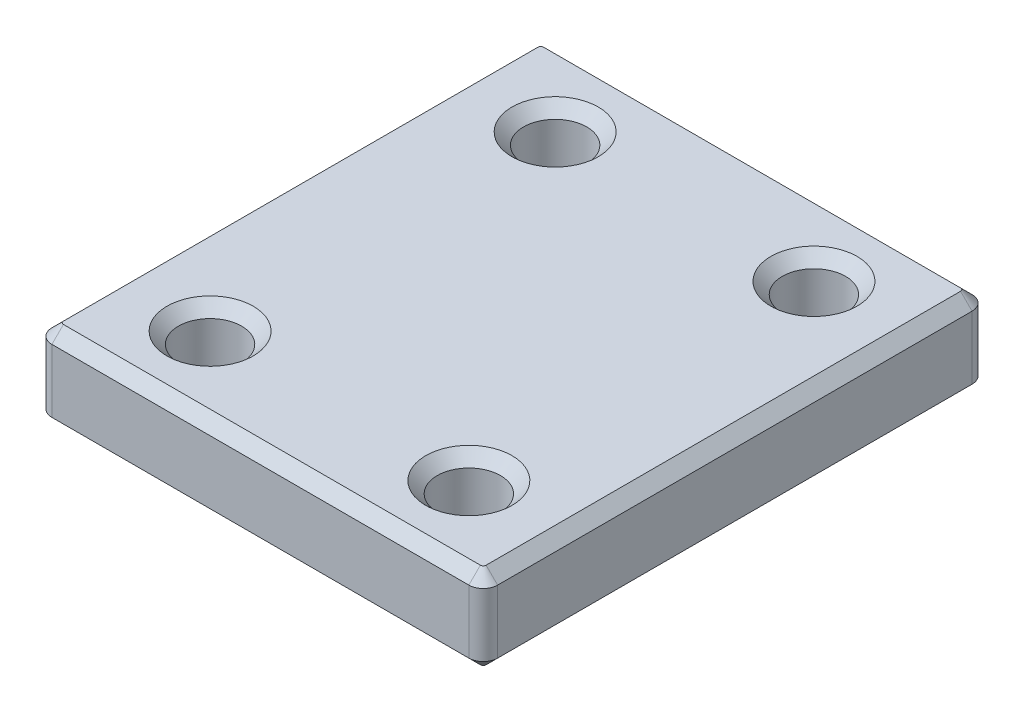
ISO-10303-21;
HEADER;
FILE_DESCRIPTION(('STEP AP214'),'2;1');
FILE_NAME('part.step','',(''),(''),'','','');
FILE_SCHEMA(('AUTOMOTIVE_DESIGN { 1 0 10303 214 1 1 1 1 }'));
ENDSEC;
DATA;
#1=APPLICATION_CONTEXT('core data for automotive mechanical design processes');
#2=APPLICATION_PROTOCOL_DEFINITION('international standard','automotive_design',2000,#1);
#3=PRODUCT_CONTEXT('',#1,'mechanical');
#4=PRODUCT('Part','Part','',(#3));
#5=PRODUCT_RELATED_PRODUCT_CATEGORY('part','',(#4));
#6=PRODUCT_DEFINITION_FORMATION('','',#4);
#7=PRODUCT_DEFINITION_CONTEXT('part definition',#1,'design');
#8=PRODUCT_DEFINITION('design','',#6,#7);
#9=PRODUCT_DEFINITION_SHAPE('','',#8);
#10=(LENGTH_UNIT() NAMED_UNIT(*) SI_UNIT(.MILLI.,.METRE.));
#11=(NAMED_UNIT(*) PLANE_ANGLE_UNIT() SI_UNIT($,.RADIAN.));
#12=(NAMED_UNIT(*) SI_UNIT($,.STERADIAN.) SOLID_ANGLE_UNIT());
#13=UNCERTAINTY_MEASURE_WITH_UNIT(LENGTH_MEASURE(1.E-05),#10,'distance_accuracy_value','');
#14=(GEOMETRIC_REPRESENTATION_CONTEXT(3) GLOBAL_UNCERTAINTY_ASSIGNED_CONTEXT((#13)) GLOBAL_UNIT_ASSIGNED_CONTEXT((#10,
#11,#12)) REPRESENTATION_CONTEXT('',''));
#15=CARTESIAN_POINT('',(0.,0.,0.));
#16=DIRECTION('',(0.,0.,1.));
#17=DIRECTION('',(1.,0.,0.));
#18=AXIS2_PLACEMENT_3D('',#15,#16,#17);
#19=CARTESIAN_POINT('',(15.5,6.,17.5));
#20=DIRECTION('',(-1.,0.,0.));
#21=DIRECTION('',(0.,0.,1.));
#22=AXIS2_PLACEMENT_3D('',#19,#20,#21);
#23=PLANE('',#22);
#24=DIRECTION('',(0.,-1.,0.));
#25=VECTOR('',#24,1.);
#26=CARTESIAN_POINT('',(15.5,6.,16.5));
#27=LINE('',#26,#25);
#28=CARTESIAN_POINT('',(15.5,5.2,16.5));
#29=VERTEX_POINT('',#28);
#30=CARTESIAN_POINT('',(15.5,0.799999999999995,16.5));
#31=VERTEX_POINT('',#30);
#32=EDGE_CURVE('E317',#29,#31,#27,.T.);
#33=ORIENTED_EDGE('',*,*,#32,.T.);
#34=DIRECTION('',(0.,0.,-1.));
#35=VECTOR('',#34,1.);
#36=CARTESIAN_POINT('',(15.5,0.799999999999995,-16.5));
#37=LINE('',#36,#35);
#38=CARTESIAN_POINT('',(15.5,0.799999999999995,-16.5));
#39=VERTEX_POINT('',#38);
#40=EDGE_CURVE('E186',#31,#39,#37,.T.);
#41=ORIENTED_EDGE('',*,*,#40,.T.);
#42=DIRECTION('',(0.,-1.,0.));
#43=VECTOR('',#42,1.);
#44=CARTESIAN_POINT('',(15.5,6.,-16.5));
#45=LINE('',#44,#43);
#46=CARTESIAN_POINT('',(15.5,5.2,-16.5));
#47=VERTEX_POINT('',#46);
#48=EDGE_CURVE('E339',#39,#47,#45,.F.);
#49=ORIENTED_EDGE('',*,*,#48,.T.);
#50=DIRECTION('',(0.,0.,1.));
#51=VECTOR('',#50,1.);
#52=CARTESIAN_POINT('',(15.5,5.2,17.5));
#53=LINE('',#52,#51);
#54=EDGE_CURVE('E184',#47,#29,#53,.T.);
#55=ORIENTED_EDGE('',*,*,#54,.T.);
#56=EDGE_LOOP('',(#33,#41,#49,#55));
#57=FACE_BOUND('',#56,.T.);
#58=ADVANCED_FACE('F35',(#57),#23,.F.);
#59=CARTESIAN_POINT('',(-15.5,6.,-17.5));
#60=DIRECTION('',(0.,0.,1.));
#61=DIRECTION('',(1.,0.,0.));
#62=AXIS2_PLACEMENT_3D('',#59,#60,#61);
#63=PLANE('',#62);
#64=DIRECTION('',(0.,-1.,0.));
#65=VECTOR('',#64,1.);
#66=CARTESIAN_POINT('',(14.5,6.,-17.5));
#67=LINE('',#66,#65);
#68=CARTESIAN_POINT('',(14.5,5.2,-17.5));
#69=VERTEX_POINT('',#68);
#70=CARTESIAN_POINT('',(14.5,0.799999999999995,-17.5));
#71=VERTEX_POINT('',#70);
#72=EDGE_CURVE('E332',#69,#71,#67,.T.);
#73=ORIENTED_EDGE('',*,*,#72,.T.);
#74=DIRECTION('',(-1.,0.,0.));
#75=VECTOR('',#74,1.);
#76=CARTESIAN_POINT('',(-14.5,0.799999999999995,-17.5));
#77=LINE('',#76,#75);
#78=CARTESIAN_POINT('',(-14.5,0.799999999999995,-17.5));
#79=VERTEX_POINT('',#78);
#80=EDGE_CURVE('E194',#71,#79,#77,.T.);
#81=ORIENTED_EDGE('',*,*,#80,.T.);
#82=DIRECTION('',(0.,-1.,0.));
#83=VECTOR('',#82,1.);
#84=CARTESIAN_POINT('',(-14.5,6.,-17.5));
#85=LINE('',#84,#83);
#86=CARTESIAN_POINT('',(-14.5,5.2,-17.5));
#87=VERTEX_POINT('',#86);
#88=EDGE_CURVE('E335',#79,#87,#85,.F.);
#89=ORIENTED_EDGE('',*,*,#88,.T.);
#90=DIRECTION('',(1.,0.,0.));
#91=VECTOR('',#90,1.);
#92=CARTESIAN_POINT('',(-15.5,5.2,-17.5));
#93=LINE('',#92,#91);
#94=EDGE_CURVE('E192',#87,#69,#93,.T.);
#95=ORIENTED_EDGE('',*,*,#94,.T.);
#96=EDGE_LOOP('',(#73,#81,#89,#95));
#97=FACE_BOUND('',#96,.T.);
#98=ADVANCED_FACE('F415',(#97),#63,.F.);
#99=CARTESIAN_POINT('',(-15.5,6.,17.5));
#100=DIRECTION('',(1.,0.,0.));
#101=DIRECTION('',(0.,0.,-1.));
#102=AXIS2_PLACEMENT_3D('',#99,#100,#101);
#103=PLANE('',#102);
#104=DIRECTION('',(0.,-1.,0.));
#105=VECTOR('',#104,1.);
#106=CARTESIAN_POINT('',(-15.5,6.,-16.5));
#107=LINE('',#106,#105);
#108=CARTESIAN_POINT('',(-15.5,5.2,-16.5));
#109=VERTEX_POINT('',#108);
#110=CARTESIAN_POINT('',(-15.5,0.799999999999995,-16.5));
#111=VERTEX_POINT('',#110);
#112=EDGE_CURVE('E324',#109,#111,#107,.T.);
#113=ORIENTED_EDGE('',*,*,#112,.T.);
#114=DIRECTION('',(0.,0.,1.));
#115=VECTOR('',#114,1.);
#116=CARTESIAN_POINT('',(-15.5,0.799999999999995,16.5));
#117=LINE('',#116,#115);
#118=CARTESIAN_POINT('',(-15.5,0.799999999999995,16.5));
#119=VERTEX_POINT('',#118);
#120=EDGE_CURVE('E203',#111,#119,#117,.T.);
#121=ORIENTED_EDGE('',*,*,#120,.T.);
#122=DIRECTION('',(0.,-1.,0.));
#123=VECTOR('',#122,1.);
#124=CARTESIAN_POINT('',(-15.5,6.,16.5));
#125=LINE('',#124,#123);
#126=CARTESIAN_POINT('',(-15.5,5.2,16.5));
#127=VERTEX_POINT('',#126);
#128=EDGE_CURVE('E329',#119,#127,#125,.F.);
#129=ORIENTED_EDGE('',*,*,#128,.T.);
#130=DIRECTION('',(0.,0.,-1.));
#131=VECTOR('',#130,1.);
#132=CARTESIAN_POINT('',(-15.5,5.2,17.5));
#133=LINE('',#132,#131);
#134=EDGE_CURVE('E201',#127,#109,#133,.T.);
#135=ORIENTED_EDGE('',*,*,#134,.T.);
#136=EDGE_LOOP('',(#113,#121,#129,#135));
#137=FACE_BOUND('',#136,.T.);
#138=ADVANCED_FACE('F399',(#137),#103,.F.);
#139=CARTESIAN_POINT('',(-15.5,6.,17.5));
#140=DIRECTION('',(0.,0.,-1.));
#141=DIRECTION('',(-1.,0.,0.));
#142=AXIS2_PLACEMENT_3D('',#139,#140,#141);
#143=PLANE('',#142);
#144=DIRECTION('',(0.,-1.,0.));
#145=VECTOR('',#144,1.);
#146=CARTESIAN_POINT('',(-14.5,6.,17.5));
#147=LINE('',#146,#145);
#148=CARTESIAN_POINT('',(-14.5,5.2,17.5));
#149=VERTEX_POINT('',#148);
#150=CARTESIAN_POINT('',(-14.5,0.799999999999995,17.5));
#151=VERTEX_POINT('',#150);
#152=EDGE_CURVE('E322',#149,#151,#147,.T.);
#153=ORIENTED_EDGE('',*,*,#152,.T.);
#154=DIRECTION('',(1.,0.,0.));
#155=VECTOR('',#154,1.);
#156=CARTESIAN_POINT('',(14.5,0.799999999999995,17.5));
#157=LINE('',#156,#155);
#158=CARTESIAN_POINT('',(14.5,0.799999999999995,17.5));
#159=VERTEX_POINT('',#158);
#160=EDGE_CURVE('E211',#151,#159,#157,.T.);
#161=ORIENTED_EDGE('',*,*,#160,.T.);
#162=DIRECTION('',(0.,-1.,0.));
#163=VECTOR('',#162,1.);
#164=CARTESIAN_POINT('',(14.5,6.,17.5));
#165=LINE('',#164,#163);
#166=CARTESIAN_POINT('',(14.5,5.2,17.5));
#167=VERTEX_POINT('',#166);
#168=EDGE_CURVE('E278',#159,#167,#165,.F.);
#169=ORIENTED_EDGE('',*,*,#168,.T.);
#170=DIRECTION('',(-1.,0.,0.));
#171=VECTOR('',#170,1.);
#172=CARTESIAN_POINT('',(-15.5,5.2,17.5));
#173=LINE('',#172,#171);
#174=EDGE_CURVE('E209',#167,#149,#173,.T.);
#175=ORIENTED_EDGE('',*,*,#174,.T.);
#176=EDGE_LOOP('',(#153,#161,#169,#175));
#177=FACE_BOUND('',#176,.T.);
#178=ADVANCED_FACE('F320',(#177),#143,.F.);
#179=CARTESIAN_POINT('',(0.,6.,0.));
#180=DIRECTION('',(0.,-1.,0.));
#181=DIRECTION('',(0.,0.,-1.));
#182=AXIS2_PLACEMENT_3D('',#179,#180,#181);
#183=PLANE('',#182);
#184=DIRECTION('',(-1.,0.,0.));
#185=VECTOR('',#184,1.);
#186=CARTESIAN_POINT('',(0.,6.,-16.7));
#187=LINE('',#186,#185);
#188=CARTESIAN_POINT('',(14.5,6.,-16.7));
#189=VERTEX_POINT('',#188);
#190=CARTESIAN_POINT('',(-14.5,6.,-16.7));
#191=VERTEX_POINT('',#190);
#192=EDGE_CURVE('E45',#189,#191,#187,.T.);
#193=ORIENTED_EDGE('',*,*,#192,.T.);
#194=CARTESIAN_POINT('',(-14.5,6.,-16.5));
#195=DIRECTION('',(0.,-1.,0.));
#196=DIRECTION('',(0.,0.,-1.));
#197=AXIS2_PLACEMENT_3D('',#194,#195,#196);
#198=CIRCLE('',#197,0.200000000000006);
#199=CARTESIAN_POINT('',(-14.7,6.,-16.5));
#200=VERTEX_POINT('',#199);
#201=EDGE_CURVE('E11',#191,#200,#198,.F.);
#202=ORIENTED_EDGE('',*,*,#201,.T.);
#203=DIRECTION('',(0.,0.,1.));
#204=VECTOR('',#203,1.);
#205=CARTESIAN_POINT('',(-14.7,6.,0.));
#206=LINE('',#205,#204);
#207=CARTESIAN_POINT('',(-14.7,6.,16.5));
#208=VERTEX_POINT('',#207);
#209=EDGE_CURVE('E249',#200,#208,#206,.T.);
#210=ORIENTED_EDGE('',*,*,#209,.T.);
#211=CARTESIAN_POINT('',(-14.5,6.,16.5));
#212=DIRECTION('',(0.,-1.,0.));
#213=DIRECTION('',(0.,0.,-1.));
#214=AXIS2_PLACEMENT_3D('',#211,#212,#213);
#215=CIRCLE('',#214,0.200000000000006);
#216=CARTESIAN_POINT('',(-14.5,6.,16.7));
#217=VERTEX_POINT('',#216);
#218=EDGE_CURVE('E251',#208,#217,#215,.F.);
#219=ORIENTED_EDGE('',*,*,#218,.T.);
#220=DIRECTION('',(1.,0.,0.));
#221=VECTOR('',#220,1.);
#222=CARTESIAN_POINT('',(0.,6.,16.7));
#223=LINE('',#222,#221);
#224=CARTESIAN_POINT('',(14.5,6.,16.7));
#225=VERTEX_POINT('',#224);
#226=EDGE_CURVE('E253',#217,#225,#223,.T.);
#227=ORIENTED_EDGE('',*,*,#226,.T.);
#228=CARTESIAN_POINT('',(14.5,6.,16.5));
#229=DIRECTION('',(0.,-1.,0.));
#230=DIRECTION('',(0.,0.,-1.));
#231=AXIS2_PLACEMENT_3D('',#228,#229,#230);
#232=CIRCLE('',#231,0.200000000000004);
#233=CARTESIAN_POINT('',(14.7,6.,16.5));
#234=VERTEX_POINT('',#233);
#235=EDGE_CURVE('E255',#225,#234,#232,.F.);
#236=ORIENTED_EDGE('',*,*,#235,.T.);
#237=DIRECTION('',(0.,0.,-1.));
#238=VECTOR('',#237,1.);
#239=CARTESIAN_POINT('',(14.7,6.,0.));
#240=LINE('',#239,#238);
#241=CARTESIAN_POINT('',(14.7,6.,-16.5));
#242=VERTEX_POINT('',#241);
#243=EDGE_CURVE('E257',#234,#242,#240,.T.);
#244=ORIENTED_EDGE('',*,*,#243,.T.);
#245=CARTESIAN_POINT('',(14.5,6.,-16.5));
#246=DIRECTION('',(0.,-1.,0.));
#247=DIRECTION('',(0.,0.,-1.));
#248=AXIS2_PLACEMENT_3D('',#245,#246,#247);
#249=CIRCLE('',#248,0.200000000000006);
#250=EDGE_CURVE('E56',#242,#189,#249,.F.);
#251=ORIENTED_EDGE('',*,*,#250,.T.);
#252=EDGE_LOOP('',(#193,#202,#210,#219,#227,#236,#244,#251));
#253=FACE_BOUND('',#252,.T.);
#254=CARTESIAN_POINT('',(9.,6.,-12.));
#255=DIRECTION('',(0.,-1.,0.));
#256=DIRECTION('',(0.,0.,-1.));
#257=AXIS2_PLACEMENT_3D('',#254,#255,#256);
#258=CIRCLE('',#257,2.99999999999999);
#259=CARTESIAN_POINT('',(9.,6.,-15.));
#260=VERTEX_POINT('',#259);
#261=EDGE_CURVE('E246',#260,#260,#258,.T.);
#262=ORIENTED_EDGE('',*,*,#261,.T.);
#263=EDGE_LOOP('',(#262));
#264=FACE_BOUND('',#263,.T.);
#265=CARTESIAN_POINT('',(-9.,6.,12.));
#266=DIRECTION('',(0.,-1.,0.));
#267=DIRECTION('',(0.,0.,-1.));
#268=AXIS2_PLACEMENT_3D('',#265,#266,#267);
#269=CIRCLE('',#268,2.99999999999999);
#270=CARTESIAN_POINT('',(-9.,6.,9.00000000000001));
#271=VERTEX_POINT('',#270);
#272=EDGE_CURVE('E243',#271,#271,#269,.T.);
#273=ORIENTED_EDGE('',*,*,#272,.T.);
#274=EDGE_LOOP('',(#273));
#275=FACE_BOUND('',#274,.T.);
#276=CARTESIAN_POINT('',(-9.,6.,-12.));
#277=DIRECTION('',(0.,-1.,0.));
#278=DIRECTION('',(0.,0.,-1.));
#279=AXIS2_PLACEMENT_3D('',#276,#277,#278);
#280=CIRCLE('',#279,2.99999999999999);
#281=CARTESIAN_POINT('',(-9.,6.,-15.));
#282=VERTEX_POINT('',#281);
#283=EDGE_CURVE('E240',#282,#282,#280,.T.);
#284=ORIENTED_EDGE('',*,*,#283,.T.);
#285=EDGE_LOOP('',(#284));
#286=FACE_BOUND('',#285,.T.);
#287=CARTESIAN_POINT('',(9.,6.,12.));
#288=DIRECTION('',(0.,-1.,0.));
#289=DIRECTION('',(0.,0.,-1.));
#290=AXIS2_PLACEMENT_3D('',#287,#288,#289);
#291=CIRCLE('',#290,2.99999999999999);
#292=CARTESIAN_POINT('',(9.,6.,9.00000000000001));
#293=VERTEX_POINT('',#292);
#294=EDGE_CURVE('E237',#293,#293,#291,.T.);
#295=ORIENTED_EDGE('',*,*,#294,.T.);
#296=EDGE_LOOP('',(#295));
#297=FACE_BOUND('',#296,.T.);
#298=ADVANCED_FACE('F386',(#253,#264,#275,#286,#297),#183,.F.);
#299=CARTESIAN_POINT('',(0.,0.,0.));
#300=DIRECTION('',(0.,-1.,0.));
#301=DIRECTION('',(0.,0.,-1.));
#302=AXIS2_PLACEMENT_3D('',#299,#300,#301);
#303=PLANE('',#302);
#304=DIRECTION('',(0.,0.,1.));
#305=VECTOR('',#304,1.);
#306=CARTESIAN_POINT('',(14.7,0.,16.5));
#307=LINE('',#306,#305);
#308=CARTESIAN_POINT('',(14.7,0.,-16.5));
#309=VERTEX_POINT('',#308);
#310=CARTESIAN_POINT('',(14.7,0.,16.5));
#311=VERTEX_POINT('',#310);
#312=EDGE_CURVE('E174',#309,#311,#307,.T.);
#313=ORIENTED_EDGE('',*,*,#312,.T.);
#314=CARTESIAN_POINT('',(14.5,0.,16.5));
#315=DIRECTION('',(0.,-1.,0.));
#316=DIRECTION('',(0.,0.,-1.));
#317=AXIS2_PLACEMENT_3D('',#314,#315,#316);
#318=CIRCLE('',#317,0.200000000000002);
#319=CARTESIAN_POINT('',(14.5,0.,16.7));
#320=VERTEX_POINT('',#319);
#321=EDGE_CURVE('E154',#311,#320,#318,.T.);
#322=ORIENTED_EDGE('',*,*,#321,.T.);
#323=DIRECTION('',(-1.,0.,0.));
#324=VECTOR('',#323,1.);
#325=CARTESIAN_POINT('',(-14.5,0.,16.7));
#326=LINE('',#325,#324);
#327=CARTESIAN_POINT('',(-14.5,0.,16.7));
#328=VERTEX_POINT('',#327);
#329=EDGE_CURVE('E162',#320,#328,#326,.T.);
#330=ORIENTED_EDGE('',*,*,#329,.T.);
#331=CARTESIAN_POINT('',(-14.5,0.,16.5));
#332=DIRECTION('',(0.,-1.,0.));
#333=DIRECTION('',(0.,0.,-1.));
#334=AXIS2_PLACEMENT_3D('',#331,#332,#333);
#335=CIRCLE('',#334,0.200000000000006);
#336=CARTESIAN_POINT('',(-14.7,0.,16.5));
#337=VERTEX_POINT('',#336);
#338=EDGE_CURVE('E168',#328,#337,#335,.T.);
#339=ORIENTED_EDGE('',*,*,#338,.T.);
#340=DIRECTION('',(0.,0.,-1.));
#341=VECTOR('',#340,1.);
#342=CARTESIAN_POINT('',(-14.7,0.,-16.5));
#343=LINE('',#342,#341);
#344=CARTESIAN_POINT('',(-14.7,0.,-16.5));
#345=VERTEX_POINT('',#344);
#346=EDGE_CURVE('E354',#337,#345,#343,.T.);
#347=ORIENTED_EDGE('',*,*,#346,.T.);
#348=CARTESIAN_POINT('',(-14.5,0.,-16.5));
#349=DIRECTION('',(0.,-1.,0.));
#350=DIRECTION('',(0.,0.,-1.));
#351=AXIS2_PLACEMENT_3D('',#348,#349,#350);
#352=CIRCLE('',#351,0.200000000000006);
#353=CARTESIAN_POINT('',(-14.5,0.,-16.7));
#354=VERTEX_POINT('',#353);
#355=EDGE_CURVE('E356',#345,#354,#352,.T.);
#356=ORIENTED_EDGE('',*,*,#355,.T.);
#357=DIRECTION('',(1.,0.,0.));
#358=VECTOR('',#357,1.);
#359=CARTESIAN_POINT('',(14.5,0.,-16.7));
#360=LINE('',#359,#358);
#361=CARTESIAN_POINT('',(14.5,0.,-16.7));
#362=VERTEX_POINT('',#361);
#363=EDGE_CURVE('E358',#354,#362,#360,.T.);
#364=ORIENTED_EDGE('',*,*,#363,.T.);
#365=CARTESIAN_POINT('',(14.5,0.,-16.5));
#366=DIRECTION('',(0.,-1.,0.));
#367=DIRECTION('',(0.,0.,-1.));
#368=AXIS2_PLACEMENT_3D('',#365,#366,#367);
#369=CIRCLE('',#368,0.200000000000006);
#370=EDGE_CURVE('E179',#362,#309,#369,.T.);
#371=ORIENTED_EDGE('',*,*,#370,.T.);
#372=EDGE_LOOP('',(#313,#322,#330,#339,#347,#356,#364,#371));
#373=FACE_BOUND('',#372,.T.);
#374=CARTESIAN_POINT('',(9.,0.,-12.));
#375=DIRECTION('',(0.,-1.,0.));
#376=DIRECTION('',(0.,0.,-1.));
#377=AXIS2_PLACEMENT_3D('',#374,#375,#376);
#378=CIRCLE('',#377,3.);
#379=CARTESIAN_POINT('',(9.,0.,-15.));
#380=VERTEX_POINT('',#379);
#381=EDGE_CURVE('E169',#380,#380,#378,.F.);
#382=ORIENTED_EDGE('',*,*,#381,.T.);
#383=EDGE_LOOP('',(#382));
#384=FACE_BOUND('',#383,.T.);
#385=CARTESIAN_POINT('',(-9.,0.,12.));
#386=DIRECTION('',(0.,-1.,0.));
#387=DIRECTION('',(0.,0.,-1.));
#388=AXIS2_PLACEMENT_3D('',#385,#386,#387);
#389=CIRCLE('',#388,3.);
#390=CARTESIAN_POINT('',(-9.,0.,9.));
#391=VERTEX_POINT('',#390);
#392=EDGE_CURVE('E348',#391,#391,#389,.F.);
#393=ORIENTED_EDGE('',*,*,#392,.T.);
#394=EDGE_LOOP('',(#393));
#395=FACE_BOUND('',#394,.T.);
#396=CARTESIAN_POINT('',(-9.,0.,-12.));
#397=DIRECTION('',(0.,-1.,0.));
#398=DIRECTION('',(0.,0.,-1.));
#399=AXIS2_PLACEMENT_3D('',#396,#397,#398);
#400=CIRCLE('',#399,3.);
#401=CARTESIAN_POINT('',(-9.,0.,-15.));
#402=VERTEX_POINT('',#401);
#403=EDGE_CURVE('E345',#402,#402,#400,.F.);
#404=ORIENTED_EDGE('',*,*,#403,.T.);
#405=EDGE_LOOP('',(#404));
#406=FACE_BOUND('',#405,.T.);
#407=CARTESIAN_POINT('',(9.,0.,12.));
#408=DIRECTION('',(0.,-1.,0.));
#409=DIRECTION('',(0.,0.,-1.));
#410=AXIS2_PLACEMENT_3D('',#407,#408,#409);
#411=CIRCLE('',#410,3.);
#412=CARTESIAN_POINT('',(9.,0.,9.));
#413=VERTEX_POINT('',#412);
#414=EDGE_CURVE('E342',#413,#413,#411,.F.);
#415=ORIENTED_EDGE('',*,*,#414,.T.);
#416=EDGE_LOOP('',(#415));
#417=FACE_BOUND('',#416,.T.);
#418=ADVANCED_FACE('F171',(#373,#384,#395,#406,#417),#303,.T.);
#419=CARTESIAN_POINT('',(9.,0.,-12.));
#420=DIRECTION('',(0.,1.,0.));
#421=DIRECTION('',(0.,0.,1.));
#422=AXIS2_PLACEMENT_3D('',#419,#420,#421);
#423=CYLINDRICAL_SURFACE('',#422,2.2);
#424=CARTESIAN_POINT('',(9.,0.800000000000001,-12.));
#425=DIRECTION('',(0.,-1.,0.));
#426=DIRECTION('',(0.,0.,-1.));
#427=AXIS2_PLACEMENT_3D('',#424,#425,#426);
#428=CIRCLE('',#427,2.2);
#429=CARTESIAN_POINT('',(9.,0.800000000000001,-14.2));
#430=VERTEX_POINT('',#429);
#431=EDGE_CURVE('E216',#430,#430,#428,.T.);
#432=ORIENTED_EDGE('',*,*,#431,.T.);
#433=EDGE_LOOP('',(#432));
#434=FACE_BOUND('',#433,.T.);
#435=CARTESIAN_POINT('',(9.,5.20000000000001,-12.));
#436=DIRECTION('',(0.,-1.,0.));
#437=DIRECTION('',(0.,0.,-1.));
#438=AXIS2_PLACEMENT_3D('',#435,#436,#437);
#439=CIRCLE('',#438,2.2);
#440=CARTESIAN_POINT('',(9.,5.20000000000001,-14.2));
#441=VERTEX_POINT('',#440);
#442=EDGE_CURVE('E213',#441,#441,#439,.F.);
#443=ORIENTED_EDGE('',*,*,#442,.T.);
#444=EDGE_LOOP('',(#443));
#445=FACE_BOUND('',#444,.T.);
#446=ADVANCED_FACE('F588',(#434,#445),#423,.F.);
#447=CARTESIAN_POINT('',(-9.,0.,12.));
#448=DIRECTION('',(0.,1.,0.));
#449=DIRECTION('',(0.,0.,1.));
#450=AXIS2_PLACEMENT_3D('',#447,#448,#449);
#451=CYLINDRICAL_SURFACE('',#450,2.2);
#452=CARTESIAN_POINT('',(-9.,0.800000000000001,12.));
#453=DIRECTION('',(0.,-1.,0.));
#454=DIRECTION('',(0.,0.,-1.));
#455=AXIS2_PLACEMENT_3D('',#452,#453,#454);
#456=CIRCLE('',#455,2.2);
#457=CARTESIAN_POINT('',(-9.,0.800000000000001,9.8));
#458=VERTEX_POINT('',#457);
#459=EDGE_CURVE('E222',#458,#458,#456,.T.);
#460=ORIENTED_EDGE('',*,*,#459,.T.);
#461=EDGE_LOOP('',(#460));
#462=FACE_BOUND('',#461,.T.);
#463=CARTESIAN_POINT('',(-9.,5.20000000000001,12.));
#464=DIRECTION('',(0.,-1.,0.));
#465=DIRECTION('',(0.,0.,-1.));
#466=AXIS2_PLACEMENT_3D('',#463,#464,#465);
#467=CIRCLE('',#466,2.2);
#468=CARTESIAN_POINT('',(-9.,5.20000000000001,9.8));
#469=VERTEX_POINT('',#468);
#470=EDGE_CURVE('E219',#469,#469,#467,.F.);
#471=ORIENTED_EDGE('',*,*,#470,.T.);
#472=EDGE_LOOP('',(#471));
#473=FACE_BOUND('',#472,.T.);
#474=ADVANCED_FACE('F579',(#462,#473),#451,.F.);
#475=CARTESIAN_POINT('',(-9.,0.,-12.));
#476=DIRECTION('',(0.,1.,0.));
#477=DIRECTION('',(0.,0.,1.));
#478=AXIS2_PLACEMENT_3D('',#475,#476,#477);
#479=CYLINDRICAL_SURFACE('',#478,2.2);
#480=CARTESIAN_POINT('',(-9.,0.800000000000001,-12.));
#481=DIRECTION('',(0.,-1.,0.));
#482=DIRECTION('',(0.,0.,-1.));
#483=AXIS2_PLACEMENT_3D('',#480,#481,#482);
#484=CIRCLE('',#483,2.2);
#485=CARTESIAN_POINT('',(-9.,0.800000000000001,-14.2));
#486=VERTEX_POINT('',#485);
#487=EDGE_CURVE('E228',#486,#486,#484,.T.);
#488=ORIENTED_EDGE('',*,*,#487,.T.);
#489=EDGE_LOOP('',(#488));
#490=FACE_BOUND('',#489,.T.);
#491=CARTESIAN_POINT('',(-9.,5.20000000000001,-12.));
#492=DIRECTION('',(0.,-1.,0.));
#493=DIRECTION('',(0.,0.,-1.));
#494=AXIS2_PLACEMENT_3D('',#491,#492,#493);
#495=CIRCLE('',#494,2.2);
#496=CARTESIAN_POINT('',(-9.,5.20000000000001,-14.2));
#497=VERTEX_POINT('',#496);
#498=EDGE_CURVE('E225',#497,#497,#495,.F.);
#499=ORIENTED_EDGE('',*,*,#498,.T.);
#500=EDGE_LOOP('',(#499));
#501=FACE_BOUND('',#500,.T.);
#502=ADVANCED_FACE('F577',(#490,#501),#479,.F.);
#503=CARTESIAN_POINT('',(9.,0.,12.));
#504=DIRECTION('',(0.,1.,0.));
#505=DIRECTION('',(0.,0.,1.));
#506=AXIS2_PLACEMENT_3D('',#503,#504,#505);
#507=CYLINDRICAL_SURFACE('',#506,2.2);
#508=CARTESIAN_POINT('',(9.,0.800000000000001,12.));
#509=DIRECTION('',(0.,-1.,0.));
#510=DIRECTION('',(0.,0.,-1.));
#511=AXIS2_PLACEMENT_3D('',#508,#509,#510);
#512=CIRCLE('',#511,2.2);
#513=CARTESIAN_POINT('',(9.,0.800000000000001,9.8));
#514=VERTEX_POINT('',#513);
#515=EDGE_CURVE('E234',#514,#514,#512,.T.);
#516=ORIENTED_EDGE('',*,*,#515,.T.);
#517=EDGE_LOOP('',(#516));
#518=FACE_BOUND('',#517,.T.);
#519=CARTESIAN_POINT('',(9.,5.20000000000001,12.));
#520=DIRECTION('',(0.,-1.,0.));
#521=DIRECTION('',(0.,0.,-1.));
#522=AXIS2_PLACEMENT_3D('',#519,#520,#521);
#523=CIRCLE('',#522,2.2);
#524=CARTESIAN_POINT('',(9.,5.20000000000001,9.8));
#525=VERTEX_POINT('',#524);
#526=EDGE_CURVE('E231',#525,#525,#523,.F.);
#527=ORIENTED_EDGE('',*,*,#526,.T.);
#528=EDGE_LOOP('',(#527));
#529=FACE_BOUND('',#528,.T.);
#530=ADVANCED_FACE('F429',(#518,#529),#507,.F.);
#531=CARTESIAN_POINT('',(-14.5,6.,16.5));
#532=DIRECTION('',(0.,-1.,0.));
#533=DIRECTION('',(0.,0.,-1.));
#534=AXIS2_PLACEMENT_3D('',#531,#532,#533);
#535=CYLINDRICAL_SURFACE('',#534,1.);
#536=ORIENTED_EDGE('',*,*,#128,.F.);
#537=CARTESIAN_POINT('',(-14.5,0.799999999999995,16.5));
#538=DIRECTION('',(0.,-1.,0.));
#539=DIRECTION('',(0.,0.,-1.));
#540=AXIS2_PLACEMENT_3D('',#537,#538,#539);
#541=CIRCLE('',#540,1.);
#542=EDGE_CURVE('E207',#119,#151,#541,.F.);
#543=ORIENTED_EDGE('',*,*,#542,.T.);
#544=ORIENTED_EDGE('',*,*,#152,.F.);
#545=CARTESIAN_POINT('',(-14.5,5.2,16.5));
#546=DIRECTION('',(0.,-1.,0.));
#547=DIRECTION('',(0.,0.,-1.));
#548=AXIS2_PLACEMENT_3D('',#545,#546,#547);
#549=CIRCLE('',#548,1.);
#550=EDGE_CURVE('E205',#149,#127,#549,.T.);
#551=ORIENTED_EDGE('',*,*,#550,.T.);
#552=EDGE_LOOP('',(#536,#543,#544,#551));
#553=FACE_BOUND('',#552,.T.);
#554=ADVANCED_FACE('F426',(#553),#535,.T.);
#555=CARTESIAN_POINT('',(-14.5,6.,-16.5));
#556=DIRECTION('',(0.,-1.,0.));
#557=DIRECTION('',(0.,0.,-1.));
#558=AXIS2_PLACEMENT_3D('',#555,#556,#557);
#559=CYLINDRICAL_SURFACE('',#558,1.);
#560=ORIENTED_EDGE('',*,*,#88,.F.);
#561=CARTESIAN_POINT('',(-14.5,0.799999999999995,-16.5));
#562=DIRECTION('',(0.,-1.,0.));
#563=DIRECTION('',(0.,0.,-1.));
#564=AXIS2_PLACEMENT_3D('',#561,#562,#563);
#565=CIRCLE('',#564,1.);
#566=EDGE_CURVE('E199',#79,#111,#565,.F.);
#567=ORIENTED_EDGE('',*,*,#566,.T.);
#568=ORIENTED_EDGE('',*,*,#112,.F.);
#569=CARTESIAN_POINT('',(-14.5,5.2,-16.5));
#570=DIRECTION('',(0.,-1.,0.));
#571=DIRECTION('',(0.,0.,-1.));
#572=AXIS2_PLACEMENT_3D('',#569,#570,#571);
#573=CIRCLE('',#572,1.);
#574=EDGE_CURVE('E196',#109,#87,#573,.T.);
#575=ORIENTED_EDGE('',*,*,#574,.T.);
#576=EDGE_LOOP('',(#560,#567,#568,#575));
#577=FACE_BOUND('',#576,.T.);
#578=ADVANCED_FACE('F404',(#577),#559,.T.);
#579=CARTESIAN_POINT('',(14.5,6.,-16.5));
#580=DIRECTION('',(0.,-1.,0.));
#581=DIRECTION('',(0.,0.,-1.));
#582=AXIS2_PLACEMENT_3D('',#579,#580,#581);
#583=CYLINDRICAL_SURFACE('',#582,1.);
#584=ORIENTED_EDGE('',*,*,#48,.F.);
#585=CARTESIAN_POINT('',(14.5,0.799999999999995,-16.5));
#586=DIRECTION('',(0.,-1.,0.));
#587=DIRECTION('',(0.,0.,-1.));
#588=AXIS2_PLACEMENT_3D('',#585,#586,#587);
#589=CIRCLE('',#588,1.);
#590=EDGE_CURVE('E190',#39,#71,#589,.F.);
#591=ORIENTED_EDGE('',*,*,#590,.T.);
#592=ORIENTED_EDGE('',*,*,#72,.F.);
#593=CARTESIAN_POINT('',(14.5,5.2,-16.5));
#594=DIRECTION('',(0.,-1.,0.));
#595=DIRECTION('',(0.,0.,-1.));
#596=AXIS2_PLACEMENT_3D('',#593,#594,#595);
#597=CIRCLE('',#596,1.);
#598=EDGE_CURVE('E188',#69,#47,#597,.T.);
#599=ORIENTED_EDGE('',*,*,#598,.T.);
#600=EDGE_LOOP('',(#584,#591,#592,#599));
#601=FACE_BOUND('',#600,.T.);
#602=ADVANCED_FACE('F372',(#601),#583,.T.);
#603=CARTESIAN_POINT('',(14.5,6.,16.5));
#604=DIRECTION('',(0.,-1.,0.));
#605=DIRECTION('',(0.,0.,-1.));
#606=AXIS2_PLACEMENT_3D('',#603,#604,#605);
#607=CYLINDRICAL_SURFACE('',#606,1.);
#608=ORIENTED_EDGE('',*,*,#168,.F.);
#609=CARTESIAN_POINT('',(14.5,0.799999999999995,16.5));
#610=DIRECTION('',(0.,-1.,0.));
#611=DIRECTION('',(0.,0.,-1.));
#612=AXIS2_PLACEMENT_3D('',#609,#610,#611);
#613=CIRCLE('',#612,1.);
#614=EDGE_CURVE('E156',#159,#31,#613,.F.);
#615=ORIENTED_EDGE('',*,*,#614,.T.);
#616=ORIENTED_EDGE('',*,*,#32,.F.);
#617=CARTESIAN_POINT('',(14.5,5.2,16.5));
#618=DIRECTION('',(0.,-1.,0.));
#619=DIRECTION('',(0.,0.,-1.));
#620=AXIS2_PLACEMENT_3D('',#617,#618,#619);
#621=CIRCLE('',#620,1.);
#622=EDGE_CURVE('E176',#29,#167,#621,.T.);
#623=ORIENTED_EDGE('',*,*,#622,.T.);
#624=EDGE_LOOP('',(#608,#615,#616,#623));
#625=FACE_BOUND('',#624,.T.);
#626=ADVANCED_FACE('F315',(#625),#607,.T.);
#627=CARTESIAN_POINT('',(-14.5,0.,-16.5));
#628=DIRECTION('',(0.,1.,0.));
#629=DIRECTION('',(0.,0.,1.));
#630=AXIS2_PLACEMENT_3D('',#627,#628,#629);
#631=CONICAL_SURFACE('',#630,0.200000000000006,0.785398163397448);
#632=DIRECTION('',(0.707106781186548,-0.707106781186548,0.));
#633=VECTOR('',#632,1.);
#634=CARTESIAN_POINT('',(-15.5,0.799999999999995,-16.5));
#635=LINE('',#634,#633);
#636=EDGE_CURVE('E272',#111,#345,#635,.T.);
#637=ORIENTED_EDGE('',*,*,#636,.F.);
#638=ORIENTED_EDGE('',*,*,#566,.F.);
#639=DIRECTION('',(0.,0.707106781186548,-0.707106781186548));
#640=VECTOR('',#639,1.);
#641=CARTESIAN_POINT('',(-14.5,0.,-16.7));
#642=LINE('',#641,#640);
#643=EDGE_CURVE('E275',#354,#79,#642,.T.);
#644=ORIENTED_EDGE('',*,*,#643,.F.);
#645=ORIENTED_EDGE('',*,*,#355,.F.);
#646=EDGE_LOOP('',(#637,#638,#644,#645));
#647=FACE_BOUND('',#646,.T.);
#648=ADVANCED_FACE('F408',(#647),#631,.T.);
#649=CARTESIAN_POINT('',(-15.5,0.799999999999995,-17.5));
#650=DIRECTION('',(0.,-0.707106781186548,-0.707106781186548));
#651=DIRECTION('',(1.,0.,0.));
#652=AXIS2_PLACEMENT_3D('',#649,#650,#651);
#653=PLANE('',#652);
#654=ORIENTED_EDGE('',*,*,#643,.T.);
#655=ORIENTED_EDGE('',*,*,#80,.F.);
#656=DIRECTION('',(0.,0.707106781186548,-0.707106781186548));
#657=VECTOR('',#656,1.);
#658=CARTESIAN_POINT('',(14.5,0.,-16.7));
#659=LINE('',#658,#657);
#660=EDGE_CURVE('E269',#362,#71,#659,.T.);
#661=ORIENTED_EDGE('',*,*,#660,.F.);
#662=ORIENTED_EDGE('',*,*,#363,.F.);
#663=EDGE_LOOP('',(#654,#655,#661,#662));
#664=FACE_BOUND('',#663,.T.);
#665=ADVANCED_FACE('F413',(#664),#653,.T.);
#666=CARTESIAN_POINT('',(-15.5,0.799999999999995,17.5));
#667=DIRECTION('',(-0.707106781186548,-0.707106781186548,0.));
#668=DIRECTION('',(0.,0.,-1.));
#669=AXIS2_PLACEMENT_3D('',#666,#667,#668);
#670=PLANE('',#669);
#671=ORIENTED_EDGE('',*,*,#636,.T.);
#672=ORIENTED_EDGE('',*,*,#346,.F.);
#673=DIRECTION('',(0.707106781186548,-0.707106781186548,0.));
#674=VECTOR('',#673,1.);
#675=CARTESIAN_POINT('',(-15.5,0.799999999999995,16.5));
#676=LINE('',#675,#674);
#677=EDGE_CURVE('E266',#119,#337,#676,.T.);
#678=ORIENTED_EDGE('',*,*,#677,.F.);
#679=ORIENTED_EDGE('',*,*,#120,.F.);
#680=EDGE_LOOP('',(#671,#672,#678,#679));
#681=FACE_BOUND('',#680,.T.);
#682=ADVANCED_FACE('F467',(#681),#670,.T.);
#683=CARTESIAN_POINT('',(14.5,0.,-16.5));
#684=DIRECTION('',(0.,1.,0.));
#685=DIRECTION('',(0.,0.,1.));
#686=AXIS2_PLACEMENT_3D('',#683,#684,#685);
#687=CONICAL_SURFACE('',#686,0.200000000000006,0.785398163397448);
#688=ORIENTED_EDGE('',*,*,#660,.T.);
#689=ORIENTED_EDGE('',*,*,#590,.F.);
#690=DIRECTION('',(0.707106781186547,0.707106781186548,0.));
#691=VECTOR('',#690,1.);
#692=CARTESIAN_POINT('',(14.7,0.,-16.5));
#693=LINE('',#692,#691);
#694=EDGE_CURVE('E263',#309,#39,#693,.T.);
#695=ORIENTED_EDGE('',*,*,#694,.F.);
#696=ORIENTED_EDGE('',*,*,#370,.F.);
#697=EDGE_LOOP('',(#688,#689,#695,#696));
#698=FACE_BOUND('',#697,.T.);
#699=ADVANCED_FACE('F365',(#698),#687,.T.);
#700=CARTESIAN_POINT('',(-14.5,0.,16.5));
#701=DIRECTION('',(0.,1.,0.));
#702=DIRECTION('',(0.,0.,1.));
#703=AXIS2_PLACEMENT_3D('',#700,#701,#702);
#704=CONICAL_SURFACE('',#703,0.200000000000006,0.785398163397448);
#705=ORIENTED_EDGE('',*,*,#677,.T.);
#706=ORIENTED_EDGE('',*,*,#338,.F.);
#707=DIRECTION('',(0.,-0.707106781186548,-0.707106781186548));
#708=VECTOR('',#707,1.);
#709=CARTESIAN_POINT('',(-14.5,0.799999999999995,17.5));
#710=LINE('',#709,#708);
#711=EDGE_CURVE('E165',#151,#328,#710,.T.);
#712=ORIENTED_EDGE('',*,*,#711,.F.);
#713=ORIENTED_EDGE('',*,*,#542,.F.);
#714=EDGE_LOOP('',(#705,#706,#712,#713));
#715=FACE_BOUND('',#714,.T.);
#716=ADVANCED_FACE('F455',(#715),#704,.T.);
#717=CARTESIAN_POINT('',(15.5,0.799999999999995,17.5));
#718=DIRECTION('',(0.707106781186548,-0.707106781186548,0.));
#719=DIRECTION('',(0.,0.,1.));
#720=AXIS2_PLACEMENT_3D('',#717,#718,#719);
#721=PLANE('',#720);
#722=ORIENTED_EDGE('',*,*,#694,.T.);
#723=ORIENTED_EDGE('',*,*,#40,.F.);
#724=DIRECTION('',(0.707106781186548,0.707106781186548,0.));
#725=VECTOR('',#724,1.);
#726=CARTESIAN_POINT('',(14.7,0.,16.5));
#727=LINE('',#726,#725);
#728=EDGE_CURVE('E159',#311,#31,#727,.T.);
#729=ORIENTED_EDGE('',*,*,#728,.F.);
#730=ORIENTED_EDGE('',*,*,#312,.F.);
#731=EDGE_LOOP('',(#722,#723,#729,#730));
#732=FACE_BOUND('',#731,.T.);
#733=ADVANCED_FACE('F368',(#732),#721,.T.);
#734=CARTESIAN_POINT('',(-15.5,0.799999999999995,17.5));
#735=DIRECTION('',(0.,-0.707106781186548,0.707106781186548));
#736=DIRECTION('',(-1.,0.,0.));
#737=AXIS2_PLACEMENT_3D('',#734,#735,#736);
#738=PLANE('',#737);
#739=ORIENTED_EDGE('',*,*,#711,.T.);
#740=ORIENTED_EDGE('',*,*,#329,.F.);
#741=DIRECTION('',(0.,-0.707106781186548,-0.707106781186548));
#742=VECTOR('',#741,1.);
#743=CARTESIAN_POINT('',(14.5,0.799999999999995,17.5));
#744=LINE('',#743,#742);
#745=EDGE_CURVE('E150',#159,#320,#744,.T.);
#746=ORIENTED_EDGE('',*,*,#745,.F.);
#747=ORIENTED_EDGE('',*,*,#160,.F.);
#748=EDGE_LOOP('',(#739,#740,#746,#747));
#749=FACE_BOUND('',#748,.T.);
#750=ADVANCED_FACE('F163',(#749),#738,.T.);
#751=CARTESIAN_POINT('',(14.5,0.,16.5));
#752=DIRECTION('',(0.,1.,0.));
#753=DIRECTION('',(0.,0.,1.));
#754=AXIS2_PLACEMENT_3D('',#751,#752,#753);
#755=CONICAL_SURFACE('',#754,0.200000000000004,0.785398163397449);
#756=ORIENTED_EDGE('',*,*,#728,.T.);
#757=ORIENTED_EDGE('',*,*,#614,.F.);
#758=ORIENTED_EDGE('',*,*,#745,.T.);
#759=ORIENTED_EDGE('',*,*,#321,.F.);
#760=EDGE_LOOP('',(#756,#757,#758,#759));
#761=FACE_BOUND('',#760,.T.);
#762=ADVANCED_FACE('F152',(#761),#755,.T.);
#763=CARTESIAN_POINT('',(9.,0.,-12.));
#764=DIRECTION('',(0.,-1.,0.));
#765=DIRECTION('',(0.,0.,-1.));
#766=AXIS2_PLACEMENT_3D('',#763,#764,#765);
#767=CONICAL_SURFACE('',#766,3.,0.785398163397447);
#768=ORIENTED_EDGE('',*,*,#431,.F.);
#769=EDGE_LOOP('',(#768));
#770=FACE_BOUND('',#769,.T.);
#771=ORIENTED_EDGE('',*,*,#381,.F.);
#772=EDGE_LOOP('',(#771));
#773=FACE_BOUND('',#772,.T.);
#774=ADVANCED_FACE('F444',(#770,#773),#767,.F.);
#775=CARTESIAN_POINT('',(-9.,0.,12.));
#776=DIRECTION('',(0.,-1.,0.));
#777=DIRECTION('',(0.,0.,-1.));
#778=AXIS2_PLACEMENT_3D('',#775,#776,#777);
#779=CONICAL_SURFACE('',#778,3.,0.785398163397447);
#780=ORIENTED_EDGE('',*,*,#459,.F.);
#781=EDGE_LOOP('',(#780));
#782=FACE_BOUND('',#781,.T.);
#783=ORIENTED_EDGE('',*,*,#392,.F.);
#784=EDGE_LOOP('',(#783));
#785=FACE_BOUND('',#784,.T.);
#786=ADVANCED_FACE('F488',(#782,#785),#779,.F.);
#787=CARTESIAN_POINT('',(-9.,0.,-12.));
#788=DIRECTION('',(0.,-1.,0.));
#789=DIRECTION('',(0.,0.,-1.));
#790=AXIS2_PLACEMENT_3D('',#787,#788,#789);
#791=CONICAL_SURFACE('',#790,3.,0.785398163397447);
#792=ORIENTED_EDGE('',*,*,#487,.F.);
#793=EDGE_LOOP('',(#792));
#794=FACE_BOUND('',#793,.T.);
#795=ORIENTED_EDGE('',*,*,#403,.F.);
#796=EDGE_LOOP('',(#795));
#797=FACE_BOUND('',#796,.T.);
#798=ADVANCED_FACE('F495',(#794,#797),#791,.F.);
#799=CARTESIAN_POINT('',(9.,0.,12.));
#800=DIRECTION('',(0.,-1.,0.));
#801=DIRECTION('',(0.,0.,-1.));
#802=AXIS2_PLACEMENT_3D('',#799,#800,#801);
#803=CONICAL_SURFACE('',#802,3.,0.785398163397447);
#804=ORIENTED_EDGE('',*,*,#515,.F.);
#805=EDGE_LOOP('',(#804));
#806=FACE_BOUND('',#805,.T.);
#807=ORIENTED_EDGE('',*,*,#414,.F.);
#808=EDGE_LOOP('',(#807));
#809=FACE_BOUND('',#808,.T.);
#810=ADVANCED_FACE('F502',(#806,#809),#803,.F.);
#811=CARTESIAN_POINT('',(14.5,6.,16.5));
#812=DIRECTION('',(0.,-1.,0.));
#813=DIRECTION('',(0.,0.,-1.));
#814=AXIS2_PLACEMENT_3D('',#811,#812,#813);
#815=CONICAL_SURFACE('',#814,0.200000000000004,0.785398163397445);
#816=DIRECTION('',(0.,0.707106781186551,-0.707106781186544));
#817=VECTOR('',#816,1.);
#818=CARTESIAN_POINT('',(14.5,5.2,17.5));
#819=LINE('',#818,#817);
#820=EDGE_CURVE('E294',#167,#225,#819,.T.);
#821=ORIENTED_EDGE('',*,*,#820,.F.);
#822=ORIENTED_EDGE('',*,*,#622,.F.);
#823=DIRECTION('',(0.707106781186544,-0.707106781186551,0.));
#824=VECTOR('',#823,1.);
#825=CARTESIAN_POINT('',(14.7,6.,16.5));
#826=LINE('',#825,#824);
#827=EDGE_CURVE('E40',#234,#29,#826,.T.);
#828=ORIENTED_EDGE('',*,*,#827,.F.);
#829=ORIENTED_EDGE('',*,*,#235,.F.);
#830=EDGE_LOOP('',(#821,#822,#828,#829));
#831=FACE_BOUND('',#830,.T.);
#832=ADVANCED_FACE('F310',(#831),#815,.T.);
#833=CARTESIAN_POINT('',(14.7,6.,0.));
#834=DIRECTION('',(-0.707106781186551,-0.707106781186544,0.));
#835=DIRECTION('',(0.,0.,-1.));
#836=AXIS2_PLACEMENT_3D('',#833,#834,#835);
#837=PLANE('',#836);
#838=ORIENTED_EDGE('',*,*,#827,.T.);
#839=ORIENTED_EDGE('',*,*,#54,.F.);
#840=DIRECTION('',(0.707106781186544,-0.707106781186551,0.));
#841=VECTOR('',#840,1.);
#842=CARTESIAN_POINT('',(14.7,6.,-16.5));
#843=LINE('',#842,#841);
#844=EDGE_CURVE('E292',#242,#47,#843,.T.);
#845=ORIENTED_EDGE('',*,*,#844,.F.);
#846=ORIENTED_EDGE('',*,*,#243,.F.);
#847=EDGE_LOOP('',(#838,#839,#845,#846));
#848=FACE_BOUND('',#847,.T.);
#849=ADVANCED_FACE('F305',(#848),#837,.F.);
#850=CARTESIAN_POINT('',(0.,6.,16.7));
#851=DIRECTION('',(0.,-0.707106781186544,-0.707106781186551));
#852=DIRECTION('',(1.,0.,0.));
#853=AXIS2_PLACEMENT_3D('',#850,#851,#852);
#854=PLANE('',#853);
#855=ORIENTED_EDGE('',*,*,#820,.T.);
#856=ORIENTED_EDGE('',*,*,#226,.F.);
#857=DIRECTION('',(0.,0.707106781186551,-0.707106781186544));
#858=VECTOR('',#857,1.);
#859=CARTESIAN_POINT('',(-14.5,5.2,17.5));
#860=LINE('',#859,#858);
#861=EDGE_CURVE('E289',#149,#217,#860,.T.);
#862=ORIENTED_EDGE('',*,*,#861,.F.);
#863=ORIENTED_EDGE('',*,*,#174,.F.);
#864=EDGE_LOOP('',(#855,#856,#862,#863));
#865=FACE_BOUND('',#864,.T.);
#866=ADVANCED_FACE('F538',(#865),#854,.F.);
#867=CARTESIAN_POINT('',(14.5,6.,-16.5));
#868=DIRECTION('',(0.,-1.,0.));
#869=DIRECTION('',(0.,0.,-1.));
#870=AXIS2_PLACEMENT_3D('',#867,#868,#869);
#871=CONICAL_SURFACE('',#870,0.200000000000006,0.785398163397443);
#872=ORIENTED_EDGE('',*,*,#844,.T.);
#873=ORIENTED_EDGE('',*,*,#598,.F.);
#874=DIRECTION('',(0.,-0.707106781186551,-0.707106781186544));
#875=VECTOR('',#874,1.);
#876=CARTESIAN_POINT('',(14.5,6.,-16.7));
#877=LINE('',#876,#875);
#878=EDGE_CURVE('E286',#189,#69,#877,.T.);
#879=ORIENTED_EDGE('',*,*,#878,.F.);
#880=ORIENTED_EDGE('',*,*,#250,.F.);
#881=EDGE_LOOP('',(#872,#873,#879,#880));
#882=FACE_BOUND('',#881,.T.);
#883=ADVANCED_FACE('F376',(#882),#871,.T.);
#884=CARTESIAN_POINT('',(-14.5,6.,16.5));
#885=DIRECTION('',(0.,-1.,0.));
#886=DIRECTION('',(0.,0.,-1.));
#887=AXIS2_PLACEMENT_3D('',#884,#885,#886);
#888=CONICAL_SURFACE('',#887,0.200000000000006,0.785398163397443);
#889=ORIENTED_EDGE('',*,*,#861,.T.);
#890=ORIENTED_EDGE('',*,*,#218,.F.);
#891=DIRECTION('',(0.707106781186544,0.707106781186551,0.));
#892=VECTOR('',#891,1.);
#893=CARTESIAN_POINT('',(-15.5,5.2,16.5));
#894=LINE('',#893,#892);
#895=EDGE_CURVE('E283',#127,#208,#894,.T.);
#896=ORIENTED_EDGE('',*,*,#895,.F.);
#897=ORIENTED_EDGE('',*,*,#550,.F.);
#898=EDGE_LOOP('',(#889,#890,#896,#897));
#899=FACE_BOUND('',#898,.T.);
#900=ADVANCED_FACE('F392',(#899),#888,.T.);
#901=CARTESIAN_POINT('',(0.,6.,-16.7));
#902=DIRECTION('',(0.,-0.707106781186544,0.707106781186551));
#903=DIRECTION('',(-1.,0.,0.));
#904=AXIS2_PLACEMENT_3D('',#901,#902,#903);
#905=PLANE('',#904);
#906=ORIENTED_EDGE('',*,*,#878,.T.);
#907=ORIENTED_EDGE('',*,*,#94,.F.);
#908=DIRECTION('',(0.,-0.707106781186551,-0.707106781186544));
#909=VECTOR('',#908,1.);
#910=CARTESIAN_POINT('',(-14.5,6.,-16.7));
#911=LINE('',#910,#909);
#912=EDGE_CURVE('E281',#191,#87,#911,.T.);
#913=ORIENTED_EDGE('',*,*,#912,.F.);
#914=ORIENTED_EDGE('',*,*,#192,.F.);
#915=EDGE_LOOP('',(#906,#907,#913,#914));
#916=FACE_BOUND('',#915,.T.);
#917=ADVANCED_FACE('F379',(#916),#905,.F.);
#918=CARTESIAN_POINT('',(-14.7,6.,0.));
#919=DIRECTION('',(0.707106781186551,-0.707106781186544,0.));
#920=DIRECTION('',(0.,0.,1.));
#921=AXIS2_PLACEMENT_3D('',#918,#919,#920);
#922=PLANE('',#921);
#923=ORIENTED_EDGE('',*,*,#895,.T.);
#924=ORIENTED_EDGE('',*,*,#209,.F.);
#925=DIRECTION('',(0.707106781186544,0.707106781186551,0.));
#926=VECTOR('',#925,1.);
#927=CARTESIAN_POINT('',(-15.5,5.2,-16.5));
#928=LINE('',#927,#926);
#929=EDGE_CURVE('E279',#109,#200,#928,.T.);
#930=ORIENTED_EDGE('',*,*,#929,.F.);
#931=ORIENTED_EDGE('',*,*,#134,.F.);
#932=EDGE_LOOP('',(#923,#924,#930,#931));
#933=FACE_BOUND('',#932,.T.);
#934=ADVANCED_FACE('F396',(#933),#922,.F.);
#935=CARTESIAN_POINT('',(-14.5,6.,-16.5));
#936=DIRECTION('',(0.,-1.,0.));
#937=DIRECTION('',(0.,0.,-1.));
#938=AXIS2_PLACEMENT_3D('',#935,#936,#937);
#939=CONICAL_SURFACE('',#938,0.200000000000006,0.785398163397443);
#940=ORIENTED_EDGE('',*,*,#912,.T.);
#941=ORIENTED_EDGE('',*,*,#574,.F.);
#942=ORIENTED_EDGE('',*,*,#929,.T.);
#943=ORIENTED_EDGE('',*,*,#201,.F.);
#944=EDGE_LOOP('',(#940,#941,#942,#943));
#945=FACE_BOUND('',#944,.T.);
#946=ADVANCED_FACE('F383',(#945),#939,.T.);
#947=CARTESIAN_POINT('',(9.,5.20000000000001,-12.));
#948=DIRECTION('',(0.,1.,0.));
#949=DIRECTION('',(0.,0.,1.));
#950=AXIS2_PLACEMENT_3D('',#947,#948,#949);
#951=CONICAL_SURFACE('',#950,2.2,0.785398163397449);
#952=ORIENTED_EDGE('',*,*,#261,.F.);
#953=EDGE_LOOP('',(#952));
#954=FACE_BOUND('',#953,.T.);
#955=ORIENTED_EDGE('',*,*,#442,.F.);
#956=EDGE_LOOP('',(#955));
#957=FACE_BOUND('',#956,.T.);
#958=ADVANCED_FACE('F517',(#954,#957),#951,.F.);
#959=CARTESIAN_POINT('',(-9.,5.20000000000001,12.));
#960=DIRECTION('',(0.,1.,0.));
#961=DIRECTION('',(0.,0.,1.));
#962=AXIS2_PLACEMENT_3D('',#959,#960,#961);
#963=CONICAL_SURFACE('',#962,2.2,0.785398163397449);
#964=ORIENTED_EDGE('',*,*,#272,.F.);
#965=EDGE_LOOP('',(#964));
#966=FACE_BOUND('',#965,.T.);
#967=ORIENTED_EDGE('',*,*,#470,.F.);
#968=EDGE_LOOP('',(#967));
#969=FACE_BOUND('',#968,.T.);
#970=ADVANCED_FACE('F557',(#966,#969),#963,.F.);
#971=CARTESIAN_POINT('',(-9.,5.20000000000001,-12.));
#972=DIRECTION('',(0.,1.,0.));
#973=DIRECTION('',(0.,0.,1.));
#974=AXIS2_PLACEMENT_3D('',#971,#972,#973);
#975=CONICAL_SURFACE('',#974,2.2,0.785398163397449);
#976=ORIENTED_EDGE('',*,*,#283,.F.);
#977=EDGE_LOOP('',(#976));
#978=FACE_BOUND('',#977,.T.);
#979=ORIENTED_EDGE('',*,*,#498,.F.);
#980=EDGE_LOOP('',(#979));
#981=FACE_BOUND('',#980,.T.);
#982=ADVANCED_FACE('F563',(#978,#981),#975,.F.);
#983=CARTESIAN_POINT('',(9.,5.20000000000001,12.));
#984=DIRECTION('',(0.,1.,0.));
#985=DIRECTION('',(0.,0.,1.));
#986=AXIS2_PLACEMENT_3D('',#983,#984,#985);
#987=CONICAL_SURFACE('',#986,2.2,0.785398163397449);
#988=ORIENTED_EDGE('',*,*,#294,.F.);
#989=EDGE_LOOP('',(#988));
#990=FACE_BOUND('',#989,.T.);
#991=ORIENTED_EDGE('',*,*,#526,.F.);
#992=EDGE_LOOP('',(#991));
#993=FACE_BOUND('',#992,.T.);
#994=ADVANCED_FACE('F38',(#990,#993),#987,.F.);
#995=CLOSED_SHELL('',(#58,#98,#138,#178,#298,#418,#446,#474,#502,#530,#554,#578,#602,#626,#648,
#665,#682,#699,#716,#733,#750,#762,#774,#786,#798,#810,#832,#849,#866,#883,#900,#917,#934,#946,
#958,#970,#982,#994));
#996=MANIFOLD_SOLID_BREP('B2',#995);
#997=ADVANCED_BREP_SHAPE_REPRESENTATION('',(#18,#996),#14);
#998=SHAPE_DEFINITION_REPRESENTATION(#9,#997);
ENDSEC;
END-ISO-10303-21;
